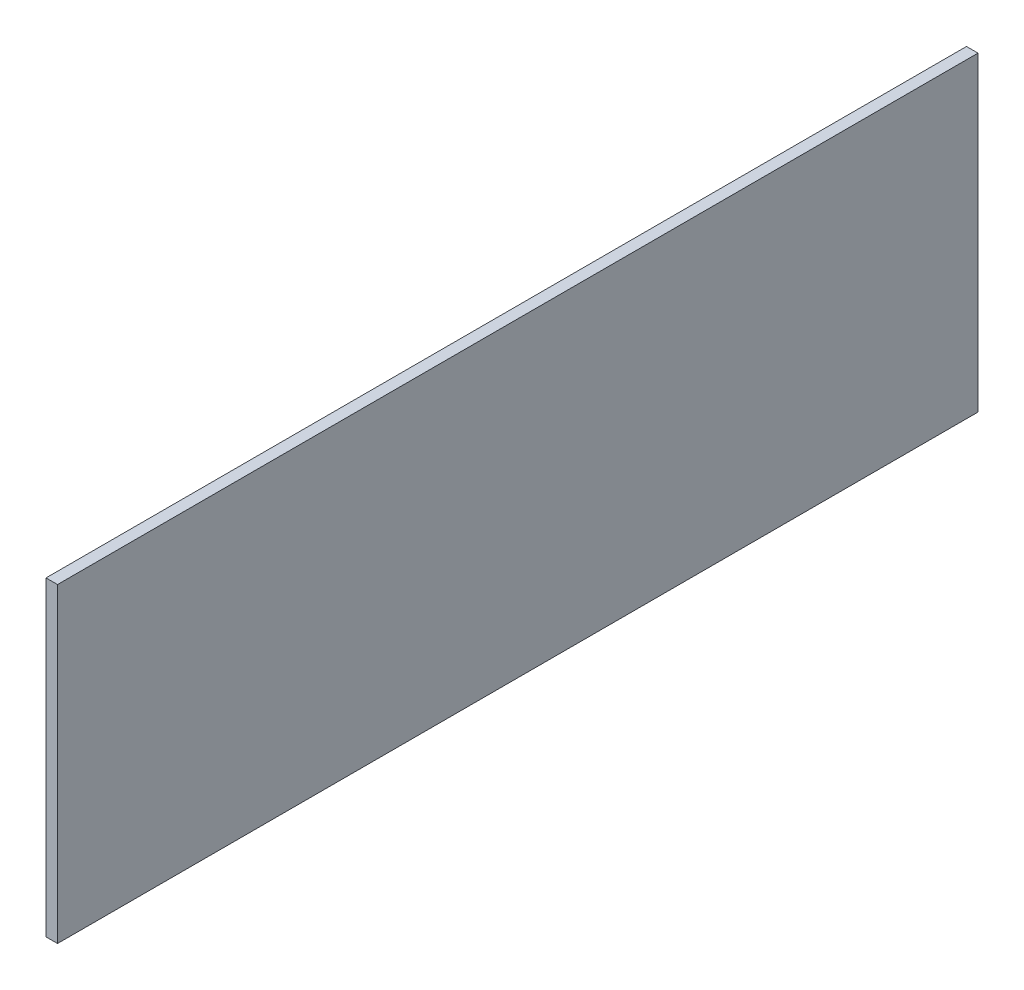
ISO-10303-21;
HEADER;
FILE_DESCRIPTION(('STEP AP214'),'2;1');
FILE_NAME('part.step','',(''),(''),'','','');
FILE_SCHEMA(('AUTOMOTIVE_DESIGN { 1 0 10303 214 1 1 1 1 }'));
ENDSEC;
DATA;
#1=APPLICATION_CONTEXT('core data for automotive mechanical design processes');
#2=APPLICATION_PROTOCOL_DEFINITION('international standard','automotive_design',2000,#1);
#3=PRODUCT_CONTEXT('',#1,'mechanical');
#4=PRODUCT('Part','Part','',(#3));
#5=PRODUCT_RELATED_PRODUCT_CATEGORY('part','',(#4));
#6=PRODUCT_DEFINITION_FORMATION('','',#4);
#7=PRODUCT_DEFINITION_CONTEXT('part definition',#1,'design');
#8=PRODUCT_DEFINITION('design','',#6,#7);
#9=PRODUCT_DEFINITION_SHAPE('','',#8);
#10=(LENGTH_UNIT() NAMED_UNIT(*) SI_UNIT(.MILLI.,.METRE.));
#11=(NAMED_UNIT(*) PLANE_ANGLE_UNIT() SI_UNIT($,.RADIAN.));
#12=(NAMED_UNIT(*) SI_UNIT($,.STERADIAN.) SOLID_ANGLE_UNIT());
#13=UNCERTAINTY_MEASURE_WITH_UNIT(LENGTH_MEASURE(1.E-05),#10,'distance_accuracy_value','');
#14=(GEOMETRIC_REPRESENTATION_CONTEXT(3) GLOBAL_UNCERTAINTY_ASSIGNED_CONTEXT((#13)) GLOBAL_UNIT_ASSIGNED_CONTEXT((#10,
#11,#12)) REPRESENTATION_CONTEXT('',''));
#15=CARTESIAN_POINT('',(0.,0.,0.));
#16=DIRECTION('',(0.,0.,1.));
#17=DIRECTION('',(1.,0.,0.));
#18=AXIS2_PLACEMENT_3D('',#15,#16,#17);
#19=CARTESIAN_POINT('',(12.7,171.577,508.));
#20=DIRECTION('',(0.,0.,-1.));
#21=DIRECTION('',(0.,1.,0.));
#22=AXIS2_PLACEMENT_3D('',#19,#20,#21);
#23=PLANE('',#22);
#24=DIRECTION('',(0.,-1.,0.));
#25=VECTOR('',#24,1.);
#26=CARTESIAN_POINT('',(0.,171.577,508.));
#27=LINE('',#26,#25);
#28=CARTESIAN_POINT('',(0.,171.577,508.));
#29=VERTEX_POINT('',#28);
#30=CARTESIAN_POINT('',(0.,-171.577,508.));
#31=VERTEX_POINT('',#30);
#32=EDGE_CURVE('E96',#29,#31,#27,.T.);
#33=ORIENTED_EDGE('',*,*,#32,.T.);
#34=DIRECTION('',(-1.,0.,0.));
#35=VECTOR('',#34,1.);
#36=CARTESIAN_POINT('',(12.7,-171.577,508.));
#37=LINE('',#36,#35);
#38=CARTESIAN_POINT('',(12.7,-171.577,508.));
#39=VERTEX_POINT('',#38);
#40=EDGE_CURVE('E11',#39,#31,#37,.T.);
#41=ORIENTED_EDGE('',*,*,#40,.F.);
#42=DIRECTION('',(0.,-1.,0.));
#43=VECTOR('',#42,1.);
#44=CARTESIAN_POINT('',(12.7,171.577,508.));
#45=LINE('',#44,#43);
#46=CARTESIAN_POINT('',(12.7,171.577,508.));
#47=VERTEX_POINT('',#46);
#48=EDGE_CURVE('E84',#47,#39,#45,.T.);
#49=ORIENTED_EDGE('',*,*,#48,.F.);
#50=DIRECTION('',(-1.,0.,0.));
#51=VECTOR('',#50,1.);
#52=CARTESIAN_POINT('',(12.7,171.577,508.));
#53=LINE('',#52,#51);
#54=EDGE_CURVE('E92',#47,#29,#53,.T.);
#55=ORIENTED_EDGE('',*,*,#54,.T.);
#56=EDGE_LOOP('',(#33,#41,#49,#55));
#57=FACE_BOUND('',#56,.T.);
#58=ADVANCED_FACE('F33',(#57),#23,.F.);
#59=CARTESIAN_POINT('',(12.7,-171.577,-508.));
#60=DIRECTION('',(0.,1.,0.));
#61=DIRECTION('',(0.,0.,1.));
#62=AXIS2_PLACEMENT_3D('',#59,#60,#61);
#63=PLANE('',#62);
#64=DIRECTION('',(0.,0.,-1.));
#65=VECTOR('',#64,1.);
#66=CARTESIAN_POINT('',(0.,-171.577,-508.));
#67=LINE('',#66,#65);
#68=CARTESIAN_POINT('',(0.,-171.577,-508.));
#69=VERTEX_POINT('',#68);
#70=EDGE_CURVE('E88',#31,#69,#67,.T.);
#71=ORIENTED_EDGE('',*,*,#70,.T.);
#72=DIRECTION('',(-1.,0.,0.));
#73=VECTOR('',#72,1.);
#74=CARTESIAN_POINT('',(12.7,-171.577,-508.));
#75=LINE('',#74,#73);
#76=CARTESIAN_POINT('',(12.7,-171.577,-508.));
#77=VERTEX_POINT('',#76);
#78=EDGE_CURVE('E41',#77,#69,#75,.T.);
#79=ORIENTED_EDGE('',*,*,#78,.F.);
#80=DIRECTION('',(0.,0.,-1.));
#81=VECTOR('',#80,1.);
#82=CARTESIAN_POINT('',(12.7,-171.577,-508.));
#83=LINE('',#82,#81);
#84=EDGE_CURVE('E79',#39,#77,#83,.T.);
#85=ORIENTED_EDGE('',*,*,#84,.F.);
#86=ORIENTED_EDGE('',*,*,#40,.T.);
#87=EDGE_LOOP('',(#71,#79,#85,#86));
#88=FACE_BOUND('',#87,.T.);
#89=ADVANCED_FACE('F87',(#88),#63,.F.);
#90=CARTESIAN_POINT('',(12.7,171.577,-508.));
#91=DIRECTION('',(0.,0.,1.));
#92=DIRECTION('',(1.,0.,0.));
#93=AXIS2_PLACEMENT_3D('',#90,#91,#92);
#94=PLANE('',#93);
#95=DIRECTION('',(0.,1.,0.));
#96=VECTOR('',#95,1.);
#97=CARTESIAN_POINT('',(0.,171.577,-508.));
#98=LINE('',#97,#96);
#99=CARTESIAN_POINT('',(0.,171.577,-508.));
#100=VERTEX_POINT('',#99);
#101=EDGE_CURVE('E66',#69,#100,#98,.T.);
#102=ORIENTED_EDGE('',*,*,#101,.T.);
#103=DIRECTION('',(-1.,0.,0.));
#104=VECTOR('',#103,1.);
#105=CARTESIAN_POINT('',(12.7,171.577,-508.));
#106=LINE('',#105,#104);
#107=CARTESIAN_POINT('',(12.7,171.577,-508.));
#108=VERTEX_POINT('',#107);
#109=EDGE_CURVE('E89',#108,#100,#106,.T.);
#110=ORIENTED_EDGE('',*,*,#109,.F.);
#111=DIRECTION('',(0.,1.,0.));
#112=VECTOR('',#111,1.);
#113=CARTESIAN_POINT('',(12.7,171.577,-508.));
#114=LINE('',#113,#112);
#115=EDGE_CURVE('E82',#77,#108,#114,.T.);
#116=ORIENTED_EDGE('',*,*,#115,.F.);
#117=ORIENTED_EDGE('',*,*,#78,.T.);
#118=EDGE_LOOP('',(#102,#110,#116,#117));
#119=FACE_BOUND('',#118,.T.);
#120=ADVANCED_FACE('F90',(#119),#94,.F.);
#121=CARTESIAN_POINT('',(12.7,171.577,-508.));
#122=DIRECTION('',(0.,-1.,0.));
#123=DIRECTION('',(0.,0.,-1.));
#124=AXIS2_PLACEMENT_3D('',#121,#122,#123);
#125=PLANE('',#124);
#126=DIRECTION('',(0.,0.,1.));
#127=VECTOR('',#126,1.);
#128=CARTESIAN_POINT('',(0.,171.577,-508.));
#129=LINE('',#128,#127);
#130=EDGE_CURVE('E72',#100,#29,#129,.T.);
#131=ORIENTED_EDGE('',*,*,#130,.T.);
#132=ORIENTED_EDGE('',*,*,#54,.F.);
#133=DIRECTION('',(0.,0.,1.));
#134=VECTOR('',#133,1.);
#135=CARTESIAN_POINT('',(12.7,171.577,-508.));
#136=LINE('',#135,#134);
#137=EDGE_CURVE('E49',#108,#47,#136,.T.);
#138=ORIENTED_EDGE('',*,*,#137,.F.);
#139=ORIENTED_EDGE('',*,*,#109,.T.);
#140=EDGE_LOOP('',(#131,#132,#138,#139));
#141=FACE_BOUND('',#140,.T.);
#142=ADVANCED_FACE('F103',(#141),#125,.F.);
#143=CARTESIAN_POINT('',(12.7,0.,0.));
#144=DIRECTION('',(-1.,0.,0.));
#145=DIRECTION('',(0.,0.,1.));
#146=AXIS2_PLACEMENT_3D('',#143,#144,#145);
#147=PLANE('',#146);
#148=ORIENTED_EDGE('',*,*,#48,.T.);
#149=ORIENTED_EDGE('',*,*,#84,.T.);
#150=ORIENTED_EDGE('',*,*,#115,.T.);
#151=ORIENTED_EDGE('',*,*,#137,.T.);
#152=EDGE_LOOP('',(#148,#149,#150,#151));
#153=FACE_BOUND('',#152,.T.);
#154=ADVANCED_FACE('F80',(#153),#147,.F.);
#155=CARTESIAN_POINT('',(0.,0.,0.));
#156=DIRECTION('',(-1.,0.,0.));
#157=DIRECTION('',(0.,0.,1.));
#158=AXIS2_PLACEMENT_3D('',#155,#156,#157);
#159=PLANE('',#158);
#160=ORIENTED_EDGE('',*,*,#32,.F.);
#161=ORIENTED_EDGE('',*,*,#130,.F.);
#162=ORIENTED_EDGE('',*,*,#101,.F.);
#163=ORIENTED_EDGE('',*,*,#70,.F.);
#164=EDGE_LOOP('',(#160,#161,#162,#163));
#165=FACE_BOUND('',#164,.T.);
#166=ADVANCED_FACE('F106',(#165),#159,.T.);
#167=CLOSED_SHELL('',(#58,#89,#120,#142,#154,#166));
#168=MANIFOLD_SOLID_BREP('B2',#167);
#169=ADVANCED_BREP_SHAPE_REPRESENTATION('',(#18,#168),#14);
#170=SHAPE_DEFINITION_REPRESENTATION(#9,#169);
ENDSEC;
END-ISO-10303-21;
